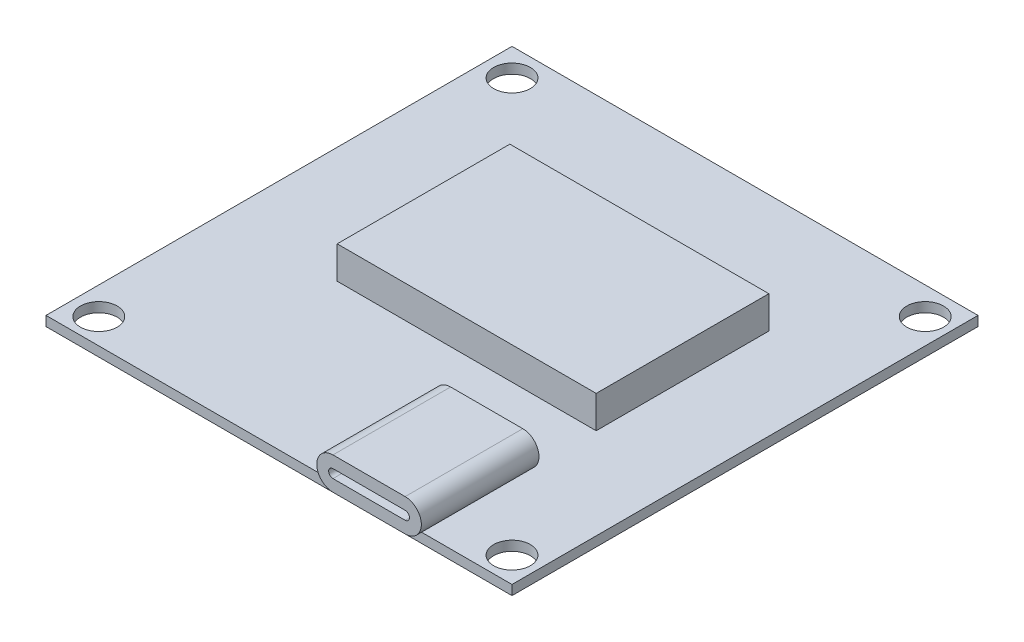
ISO-10303-21;
HEADER;
FILE_DESCRIPTION(('STEP AP214'),'2;1');
FILE_NAME('part.step','',(''),(''),'','','');
FILE_SCHEMA(('AUTOMOTIVE_DESIGN { 1 0 10303 214 1 1 1 1 }'));
ENDSEC;
DATA;
#1=APPLICATION_CONTEXT('core data for automotive mechanical design processes');
#2=APPLICATION_PROTOCOL_DEFINITION('international standard','automotive_design',2000,#1);
#3=PRODUCT_CONTEXT('',#1,'mechanical');
#4=PRODUCT('Part','Part','',(#3));
#5=PRODUCT_RELATED_PRODUCT_CATEGORY('part','',(#4));
#6=PRODUCT_DEFINITION_FORMATION('','',#4);
#7=PRODUCT_DEFINITION_CONTEXT('part definition',#1,'design');
#8=PRODUCT_DEFINITION('design','',#6,#7);
#9=PRODUCT_DEFINITION_SHAPE('','',#8);
#10=(LENGTH_UNIT() NAMED_UNIT(*) SI_UNIT(.MILLI.,.METRE.));
#11=(NAMED_UNIT(*) PLANE_ANGLE_UNIT() SI_UNIT($,.RADIAN.));
#12=(NAMED_UNIT(*) SI_UNIT($,.STERADIAN.) SOLID_ANGLE_UNIT());
#13=UNCERTAINTY_MEASURE_WITH_UNIT(LENGTH_MEASURE(1.E-05),#10,'distance_accuracy_value','');
#14=(GEOMETRIC_REPRESENTATION_CONTEXT(3) GLOBAL_UNCERTAINTY_ASSIGNED_CONTEXT((#13)) GLOBAL_UNIT_ASSIGNED_CONTEXT((#10,
#11,#12)) REPRESENTATION_CONTEXT('',''));
#15=CARTESIAN_POINT('',(0.,0.,0.));
#16=DIRECTION('',(0.,0.,1.));
#17=DIRECTION('',(1.,0.,0.));
#18=AXIS2_PLACEMENT_3D('',#15,#16,#17);
#19=CARTESIAN_POINT('',(0.,0.9,0.));
#20=DIRECTION('',(0.,-1.,0.));
#21=DIRECTION('',(0.,0.,-1.));
#22=AXIS2_PLACEMENT_3D('',#19,#20,#21);
#23=PLANE('',#22);
#24=DIRECTION('',(0.,0.,1.));
#25=VECTOR('',#24,1.);
#26=CARTESIAN_POINT('',(27.49,0.9,-10.));
#27=LINE('',#26,#25);
#28=CARTESIAN_POINT('',(27.49,0.9,-10.));
#29=VERTEX_POINT('',#28);
#30=CARTESIAN_POINT('',(27.49,0.9,0.));
#31=VERTEX_POINT('',#30);
#32=EDGE_CURVE('E244',#29,#31,#27,.T.);
#33=ORIENTED_EDGE('',*,*,#32,.F.);
#34=DIRECTION('',(1.,0.,0.));
#35=VECTOR('',#34,1.);
#36=CARTESIAN_POINT('',(27.49,0.9,-10.));
#37=LINE('',#36,#35);
#38=CARTESIAN_POINT('',(34.18,0.9,-10.));
#39=VERTEX_POINT('',#38);
#40=EDGE_CURVE('E227',#29,#39,#37,.T.);
#41=ORIENTED_EDGE('',*,*,#40,.T.);
#42=DIRECTION('',(0.,0.,1.));
#43=VECTOR('',#42,1.);
#44=CARTESIAN_POINT('',(34.18,0.9,-10.));
#45=LINE('',#44,#43);
#46=CARTESIAN_POINT('',(34.18,0.9,0.));
#47=VERTEX_POINT('',#46);
#48=EDGE_CURVE('E241',#39,#47,#45,.T.);
#49=ORIENTED_EDGE('',*,*,#48,.T.);
#50=DIRECTION('',(1.,0.,0.));
#51=VECTOR('',#50,1.);
#52=CARTESIAN_POINT('',(0.,0.9,0.));
#53=LINE('',#52,#51);
#54=CARTESIAN_POINT('',(43.18,0.9,0.));
#55=VERTEX_POINT('',#54);
#56=EDGE_CURVE('E274',#47,#55,#53,.T.);
#57=ORIENTED_EDGE('',*,*,#56,.T.);
#58=DIRECTION('',(0.,0.,-1.));
#59=VECTOR('',#58,1.);
#60=CARTESIAN_POINT('',(43.18,0.9,0.));
#61=LINE('',#60,#59);
#62=CARTESIAN_POINT('',(43.18,0.9,-43.18));
#63=VERTEX_POINT('',#62);
#64=EDGE_CURVE('E279',#55,#63,#61,.T.);
#65=ORIENTED_EDGE('',*,*,#64,.T.);
#66=DIRECTION('',(-1.,0.,0.));
#67=VECTOR('',#66,1.);
#68=CARTESIAN_POINT('',(0.,0.9,-43.18));
#69=LINE('',#68,#67);
#70=CARTESIAN_POINT('',(0.,0.9,-43.18));
#71=VERTEX_POINT('',#70);
#72=EDGE_CURVE('E282',#63,#71,#69,.T.);
#73=ORIENTED_EDGE('',*,*,#72,.T.);
#74=DIRECTION('',(0.,0.,1.));
#75=VECTOR('',#74,1.);
#76=CARTESIAN_POINT('',(0.,0.9,0.));
#77=LINE('',#76,#75);
#78=CARTESIAN_POINT('',(0.,0.9,0.));
#79=VERTEX_POINT('',#78);
#80=EDGE_CURVE('E271',#71,#79,#77,.T.);
#81=ORIENTED_EDGE('',*,*,#80,.T.);
#82=EDGE_CURVE('E276',#79,#31,#53,.T.);
#83=ORIENTED_EDGE('',*,*,#82,.T.);
#84=EDGE_LOOP('',(#33,#41,#49,#57,#65,#73,#81,#83));
#85=FACE_BOUND('',#84,.T.);
#86=CARTESIAN_POINT('',(2.54000000000008,0.9,-2.35356503375575));
#87=DIRECTION('',(0.,1.,0.));
#88=DIRECTION('',(1.,0.,0.));
#89=AXIS2_PLACEMENT_3D('',#86,#87,#88);
#90=CIRCLE('',#89,1.7);
#91=CARTESIAN_POINT('',(4.24000000000008,0.9,-2.35356503375576));
#92=VERTEX_POINT('',#91);
#93=EDGE_CURVE('E247',#92,#92,#90,.T.);
#94=ORIENTED_EDGE('',*,*,#93,.F.);
#95=EDGE_LOOP('',(#94));
#96=FACE_BOUND('',#95,.T.);
#97=CARTESIAN_POINT('',(40.8264349662442,0.9,-2.35356503375583));
#98=DIRECTION('',(0.,1.,0.));
#99=DIRECTION('',(0.,0.,-1.));
#100=AXIS2_PLACEMENT_3D('',#97,#98,#99);
#101=CIRCLE('',#100,1.7);
#102=CARTESIAN_POINT('',(40.8264349662442,0.9,-4.05356503375583));
#103=VERTEX_POINT('',#102);
#104=EDGE_CURVE('E254',#103,#103,#101,.T.);
#105=ORIENTED_EDGE('',*,*,#104,.F.);
#106=EDGE_LOOP('',(#105));
#107=FACE_BOUND('',#106,.T.);
#108=CARTESIAN_POINT('',(40.826434966244,0.9,-40.6400000000002));
#109=DIRECTION('',(0.,1.,0.));
#110=DIRECTION('',(-1.,0.,0.));
#111=AXIS2_PLACEMENT_3D('',#108,#109,#110);
#112=CIRCLE('',#111,1.7);
#113=CARTESIAN_POINT('',(39.126434966244,0.9,-40.6400000000002));
#114=VERTEX_POINT('',#113);
#115=EDGE_CURVE('E260',#114,#114,#112,.T.);
#116=ORIENTED_EDGE('',*,*,#115,.F.);
#117=EDGE_LOOP('',(#116));
#118=FACE_BOUND('',#117,.T.);
#119=CARTESIAN_POINT('',(2.54,0.9,-40.64));
#120=DIRECTION('',(0.,1.,0.));
#121=DIRECTION('',(0.,0.,1.));
#122=AXIS2_PLACEMENT_3D('',#119,#120,#121);
#123=CIRCLE('',#122,1.7);
#124=CARTESIAN_POINT('',(2.54,0.9,-38.94));
#125=VERTEX_POINT('',#124);
#126=EDGE_CURVE('E265',#125,#125,#123,.T.);
#127=ORIENTED_EDGE('',*,*,#126,.F.);
#128=EDGE_LOOP('',(#127));
#129=FACE_BOUND('',#128,.T.);
#130=DIRECTION('',(0.,0.,-1.));
#131=VECTOR('',#130,1.);
#132=CARTESIAN_POINT('',(34.7476530507671,0.9,-32.23255055401));
#133=LINE('',#132,#131);
#134=CARTESIAN_POINT('',(34.7476530507671,0.9,-16.23255055401));
#135=VERTEX_POINT('',#134);
#136=CARTESIAN_POINT('',(34.7476530507671,0.9,-32.23255055401));
#137=VERTEX_POINT('',#136);
#138=EDGE_CURVE('E174',#135,#137,#133,.T.);
#139=ORIENTED_EDGE('',*,*,#138,.F.);
#140=DIRECTION('',(1.,0.,0.));
#141=VECTOR('',#140,1.);
#142=CARTESIAN_POINT('',(34.7476530507671,0.9,-16.23255055401));
#143=LINE('',#142,#141);
#144=CARTESIAN_POINT('',(10.7476530507671,0.9,-16.23255055401));
#145=VERTEX_POINT('',#144);
#146=EDGE_CURVE('E171',#145,#135,#143,.T.);
#147=ORIENTED_EDGE('',*,*,#146,.F.);
#148=DIRECTION('',(0.,0.,1.));
#149=VECTOR('',#148,1.);
#150=CARTESIAN_POINT('',(10.7476530507671,0.9,-32.23255055401));
#151=LINE('',#150,#149);
#152=CARTESIAN_POINT('',(10.7476530507671,0.9,-32.23255055401));
#153=VERTEX_POINT('',#152);
#154=EDGE_CURVE('E55',#153,#145,#151,.T.);
#155=ORIENTED_EDGE('',*,*,#154,.F.);
#156=DIRECTION('',(-1.,0.,0.));
#157=VECTOR('',#156,1.);
#158=CARTESIAN_POINT('',(34.7476530507671,0.9,-32.23255055401));
#159=LINE('',#158,#157);
#160=EDGE_CURVE('E50',#137,#153,#159,.T.);
#161=ORIENTED_EDGE('',*,*,#160,.F.);
#162=EDGE_LOOP('',(#139,#147,#155,#161));
#163=FACE_BOUND('',#162,.T.);
#164=ADVANCED_FACE('F35',(#85,#96,#107,#118,#129,#163),#23,.F.);
#165=CARTESIAN_POINT('',(0.,0.9,0.));
#166=DIRECTION('',(1.,0.,0.));
#167=DIRECTION('',(0.,0.,-1.));
#168=AXIS2_PLACEMENT_3D('',#165,#166,#167);
#169=PLANE('',#168);
#170=DIRECTION('',(0.,0.,1.));
#171=VECTOR('',#170,1.);
#172=CARTESIAN_POINT('',(0.,0.,0.));
#173=LINE('',#172,#171);
#174=CARTESIAN_POINT('',(0.,0.,-43.18));
#175=VERTEX_POINT('',#174);
#176=CARTESIAN_POINT('',(0.,0.,0.));
#177=VERTEX_POINT('',#176);
#178=EDGE_CURVE('E268',#175,#177,#173,.T.);
#179=ORIENTED_EDGE('',*,*,#178,.T.);
#180=DIRECTION('',(0.,-1.,0.));
#181=VECTOR('',#180,1.);
#182=CARTESIAN_POINT('',(0.,0.9,0.));
#183=LINE('',#182,#181);
#184=EDGE_CURVE('E11',#79,#177,#183,.T.);
#185=ORIENTED_EDGE('',*,*,#184,.F.);
#186=ORIENTED_EDGE('',*,*,#80,.F.);
#187=DIRECTION('',(0.,-1.,0.));
#188=VECTOR('',#187,1.);
#189=CARTESIAN_POINT('',(0.,0.9,-43.18));
#190=LINE('',#189,#188);
#191=EDGE_CURVE('E284',#71,#175,#190,.T.);
#192=ORIENTED_EDGE('',*,*,#191,.T.);
#193=EDGE_LOOP('',(#179,#185,#186,#192));
#194=FACE_BOUND('',#193,.T.);
#195=ADVANCED_FACE('F37',(#194),#169,.F.);
#196=CARTESIAN_POINT('',(0.,0.9,0.));
#197=DIRECTION('',(0.,0.,-1.));
#198=DIRECTION('',(-1.,0.,0.));
#199=AXIS2_PLACEMENT_3D('',#196,#197,#198);
#200=PLANE('',#199);
#201=DIRECTION('',(1.,0.,0.));
#202=VECTOR('',#201,1.);
#203=CARTESIAN_POINT('',(0.,0.,0.));
#204=LINE('',#203,#202);
#205=CARTESIAN_POINT('',(43.18,0.,0.));
#206=VERTEX_POINT('',#205);
#207=EDGE_CURVE('E287',#177,#206,#204,.T.);
#208=ORIENTED_EDGE('',*,*,#207,.T.);
#209=DIRECTION('',(0.,-1.,0.));
#210=VECTOR('',#209,1.);
#211=CARTESIAN_POINT('',(43.18,0.9,0.));
#212=LINE('',#211,#210);
#213=EDGE_CURVE('E43',#55,#206,#212,.T.);
#214=ORIENTED_EDGE('',*,*,#213,.F.);
#215=ORIENTED_EDGE('',*,*,#56,.F.);
#216=EDGE_CURVE('E280',#31,#47,#53,.T.);
#217=ORIENTED_EDGE('',*,*,#216,.F.);
#218=ORIENTED_EDGE('',*,*,#82,.F.);
#219=ORIENTED_EDGE('',*,*,#184,.T.);
#220=EDGE_LOOP('',(#208,#214,#215,#217,#218,#219));
#221=FACE_BOUND('',#220,.T.);
#222=ADVANCED_FACE('F363',(#221),#200,.F.);
#223=CARTESIAN_POINT('',(43.18,0.9,0.));
#224=DIRECTION('',(-1.,0.,0.));
#225=DIRECTION('',(0.,0.,1.));
#226=AXIS2_PLACEMENT_3D('',#223,#224,#225);
#227=PLANE('',#226);
#228=DIRECTION('',(0.,0.,-1.));
#229=VECTOR('',#228,1.);
#230=CARTESIAN_POINT('',(43.18,0.,0.));
#231=LINE('',#230,#229);
#232=CARTESIAN_POINT('',(43.18,0.,-43.18));
#233=VERTEX_POINT('',#232);
#234=EDGE_CURVE('E289',#206,#233,#231,.T.);
#235=ORIENTED_EDGE('',*,*,#234,.T.);
#236=DIRECTION('',(0.,-1.,0.));
#237=VECTOR('',#236,1.);
#238=CARTESIAN_POINT('',(43.18,0.9,-43.18));
#239=LINE('',#238,#237);
#240=EDGE_CURVE('E294',#63,#233,#239,.T.);
#241=ORIENTED_EDGE('',*,*,#240,.F.);
#242=ORIENTED_EDGE('',*,*,#64,.F.);
#243=ORIENTED_EDGE('',*,*,#213,.T.);
#244=EDGE_LOOP('',(#235,#241,#242,#243));
#245=FACE_BOUND('',#244,.T.);
#246=ADVANCED_FACE('F301',(#245),#227,.F.);
#247=CARTESIAN_POINT('',(0.,0.9,-43.18));
#248=DIRECTION('',(0.,0.,1.));
#249=DIRECTION('',(1.,0.,0.));
#250=AXIS2_PLACEMENT_3D('',#247,#248,#249);
#251=PLANE('',#250);
#252=DIRECTION('',(-1.,0.,0.));
#253=VECTOR('',#252,1.);
#254=CARTESIAN_POINT('',(0.,0.,-43.18));
#255=LINE('',#254,#253);
#256=EDGE_CURVE('E275',#233,#175,#255,.T.);
#257=ORIENTED_EDGE('',*,*,#256,.T.);
#258=ORIENTED_EDGE('',*,*,#191,.F.);
#259=ORIENTED_EDGE('',*,*,#72,.F.);
#260=ORIENTED_EDGE('',*,*,#240,.T.);
#261=EDGE_LOOP('',(#257,#258,#259,#260));
#262=FACE_BOUND('',#261,.T.);
#263=ADVANCED_FACE('F311',(#262),#251,.F.);
#264=CARTESIAN_POINT('',(0.,0.,0.));
#265=DIRECTION('',(0.,-1.,0.));
#266=DIRECTION('',(0.,0.,-1.));
#267=AXIS2_PLACEMENT_3D('',#264,#265,#266);
#268=PLANE('',#267);
#269=CARTESIAN_POINT('',(2.54000000000008,0.,-2.35356503375575));
#270=DIRECTION('',(0.,-1.,0.));
#271=DIRECTION('',(0.,0.,-1.));
#272=AXIS2_PLACEMENT_3D('',#269,#270,#271);
#273=CIRCLE('',#272,1.7);
#274=CARTESIAN_POINT('',(2.54000000000008,0.,-4.05356503375575));
#275=VERTEX_POINT('',#274);
#276=EDGE_CURVE('E251',#275,#275,#273,.F.);
#277=ORIENTED_EDGE('',*,*,#276,.T.);
#278=EDGE_LOOP('',(#277));
#279=FACE_BOUND('',#278,.T.);
#280=CARTESIAN_POINT('',(40.8264349662442,0.,-2.35356503375583));
#281=DIRECTION('',(0.,-1.,0.));
#282=DIRECTION('',(0.,0.,-1.));
#283=AXIS2_PLACEMENT_3D('',#280,#281,#282);
#284=CIRCLE('',#283,1.7);
#285=CARTESIAN_POINT('',(40.8264349662442,0.,-4.05356503375583));
#286=VERTEX_POINT('',#285);
#287=EDGE_CURVE('E257',#286,#286,#284,.F.);
#288=ORIENTED_EDGE('',*,*,#287,.T.);
#289=EDGE_LOOP('',(#288));
#290=FACE_BOUND('',#289,.T.);
#291=CARTESIAN_POINT('',(40.826434966244,0.,-40.6400000000002));
#292=DIRECTION('',(0.,-1.,0.));
#293=DIRECTION('',(0.,0.,-1.));
#294=AXIS2_PLACEMENT_3D('',#291,#292,#293);
#295=CIRCLE('',#294,1.7);
#296=CARTESIAN_POINT('',(40.826434966244,0.,-42.3400000000002));
#297=VERTEX_POINT('',#296);
#298=EDGE_CURVE('E238',#297,#297,#295,.F.);
#299=ORIENTED_EDGE('',*,*,#298,.T.);
#300=EDGE_LOOP('',(#299));
#301=FACE_BOUND('',#300,.T.);
#302=CARTESIAN_POINT('',(2.54,0.,-40.64));
#303=DIRECTION('',(0.,-1.,0.));
#304=DIRECTION('',(0.,0.,-1.));
#305=AXIS2_PLACEMENT_3D('',#302,#303,#304);
#306=CIRCLE('',#305,1.7);
#307=CARTESIAN_POINT('',(2.54,0.,-42.34));
#308=VERTEX_POINT('',#307);
#309=EDGE_CURVE('E250',#308,#308,#306,.F.);
#310=ORIENTED_EDGE('',*,*,#309,.T.);
#311=EDGE_LOOP('',(#310));
#312=FACE_BOUND('',#311,.T.);
#313=ORIENTED_EDGE('',*,*,#178,.F.);
#314=ORIENTED_EDGE('',*,*,#256,.F.);
#315=ORIENTED_EDGE('',*,*,#234,.F.);
#316=ORIENTED_EDGE('',*,*,#207,.F.);
#317=EDGE_LOOP('',(#313,#314,#315,#316));
#318=FACE_BOUND('',#317,.T.);
#319=ADVANCED_FACE('F308',(#279,#290,#301,#312,#318),#268,.T.);
#320=CARTESIAN_POINT('',(2.54,-0.00100000000000002,-40.64));
#321=DIRECTION('',(0.,1.,0.));
#322=DIRECTION('',(0.,0.,1.));
#323=AXIS2_PLACEMENT_3D('',#320,#321,#322);
#324=CYLINDRICAL_SURFACE('',#323,1.7);
#325=ORIENTED_EDGE('',*,*,#309,.F.);
#326=EDGE_LOOP('',(#325));
#327=FACE_BOUND('',#326,.T.);
#328=ORIENTED_EDGE('',*,*,#126,.T.);
#329=EDGE_LOOP('',(#328));
#330=FACE_BOUND('',#329,.T.);
#331=ADVANCED_FACE('F366',(#327,#330),#324,.F.);
#332=CARTESIAN_POINT('',(40.826434966244,-0.00100000000000002,-40.6400000000002));
#333=DIRECTION('',(0.,1.,0.));
#334=DIRECTION('',(0.,0.,1.));
#335=AXIS2_PLACEMENT_3D('',#332,#333,#334);
#336=CYLINDRICAL_SURFACE('',#335,1.7);
#337=ORIENTED_EDGE('',*,*,#298,.F.);
#338=EDGE_LOOP('',(#337));
#339=FACE_BOUND('',#338,.T.);
#340=ORIENTED_EDGE('',*,*,#115,.T.);
#341=EDGE_LOOP('',(#340));
#342=FACE_BOUND('',#341,.T.);
#343=ADVANCED_FACE('F514',(#339,#342),#336,.F.);
#344=CARTESIAN_POINT('',(40.8264349662442,-0.00100000000000002,-2.35356503375583));
#345=DIRECTION('',(0.,1.,0.));
#346=DIRECTION('',(0.,0.,1.));
#347=AXIS2_PLACEMENT_3D('',#344,#345,#346);
#348=CYLINDRICAL_SURFACE('',#347,1.7);
#349=ORIENTED_EDGE('',*,*,#287,.F.);
#350=EDGE_LOOP('',(#349));
#351=FACE_BOUND('',#350,.T.);
#352=ORIENTED_EDGE('',*,*,#104,.T.);
#353=EDGE_LOOP('',(#352));
#354=FACE_BOUND('',#353,.T.);
#355=ADVANCED_FACE('F509',(#351,#354),#348,.F.);
#356=CARTESIAN_POINT('',(2.54000000000008,-0.00100000000000002,-2.35356503375575));
#357=DIRECTION('',(0.,1.,0.));
#358=DIRECTION('',(0.,0.,1.));
#359=AXIS2_PLACEMENT_3D('',#356,#357,#358);
#360=CYLINDRICAL_SURFACE('',#359,1.7);
#361=ORIENTED_EDGE('',*,*,#276,.F.);
#362=EDGE_LOOP('',(#361));
#363=FACE_BOUND('',#362,.T.);
#364=ORIENTED_EDGE('',*,*,#93,.T.);
#365=EDGE_LOOP('',(#364));
#366=FACE_BOUND('',#365,.T.);
#367=ADVANCED_FACE('F381',(#363,#366),#360,.F.);
#368=CARTESIAN_POINT('',(27.49,0.9,-10.));
#369=DIRECTION('',(0.,-1.,0.));
#370=DIRECTION('',(0.,0.,-1.));
#371=AXIS2_PLACEMENT_3D('',#368,#369,#370);
#372=PLANE('',#371);
#373=ORIENTED_EDGE('',*,*,#216,.T.);
#374=CARTESIAN_POINT('',(34.18,0.9,0.9));
#375=VERTEX_POINT('',#374);
#376=EDGE_CURVE('E243',#47,#375,#45,.T.);
#377=ORIENTED_EDGE('',*,*,#376,.T.);
#378=DIRECTION('',(1.,0.,0.));
#379=VECTOR('',#378,1.);
#380=CARTESIAN_POINT('',(27.49,0.9,0.9));
#381=LINE('',#380,#379);
#382=CARTESIAN_POINT('',(27.49,0.9,0.9));
#383=VERTEX_POINT('',#382);
#384=EDGE_CURVE('E195',#383,#375,#381,.T.);
#385=ORIENTED_EDGE('',*,*,#384,.F.);
#386=EDGE_CURVE('E235',#31,#383,#27,.T.);
#387=ORIENTED_EDGE('',*,*,#386,.F.);
#388=EDGE_LOOP('',(#373,#377,#385,#387));
#389=FACE_BOUND('',#388,.T.);
#390=ADVANCED_FACE('F323',(#389),#372,.T.);
#391=CARTESIAN_POINT('',(27.49,2.4,-10.));
#392=DIRECTION('',(0.,0.,1.));
#393=DIRECTION('',(1.,0.,0.));
#394=AXIS2_PLACEMENT_3D('',#391,#392,#393);
#395=CYLINDRICAL_SURFACE('',#394,1.5);
#396=ORIENTED_EDGE('',*,*,#32,.T.);
#397=ORIENTED_EDGE('',*,*,#386,.T.);
#398=CARTESIAN_POINT('',(27.49,2.4,0.9));
#399=DIRECTION('',(0.,0.,1.));
#400=DIRECTION('',(1.,0.,0.));
#401=AXIS2_PLACEMENT_3D('',#398,#399,#400);
#402=CIRCLE('',#401,1.5);
#403=CARTESIAN_POINT('',(27.49,3.9,0.9));
#404=VERTEX_POINT('',#403);
#405=EDGE_CURVE('E192',#404,#383,#402,.T.);
#406=ORIENTED_EDGE('',*,*,#405,.F.);
#407=DIRECTION('',(0.,0.,1.));
#408=VECTOR('',#407,1.);
#409=CARTESIAN_POINT('',(27.49,3.9,-10.));
#410=LINE('',#409,#408);
#411=CARTESIAN_POINT('',(27.49,3.9,-10.));
#412=VERTEX_POINT('',#411);
#413=EDGE_CURVE('E236',#412,#404,#410,.T.);
#414=ORIENTED_EDGE('',*,*,#413,.F.);
#415=CARTESIAN_POINT('',(27.49,2.4,-10.));
#416=DIRECTION('',(0.,0.,1.));
#417=DIRECTION('',(1.,0.,0.));
#418=AXIS2_PLACEMENT_3D('',#415,#416,#417);
#419=CIRCLE('',#418,1.5);
#420=EDGE_CURVE('E219',#412,#29,#419,.T.);
#421=ORIENTED_EDGE('',*,*,#420,.T.);
#422=EDGE_LOOP('',(#396,#397,#406,#414,#421));
#423=FACE_BOUND('',#422,.T.);
#424=ADVANCED_FACE('F339',(#423),#395,.T.);
#425=CARTESIAN_POINT('',(27.49,3.9,-10.));
#426=DIRECTION('',(0.,1.,0.));
#427=DIRECTION('',(0.,0.,1.));
#428=AXIS2_PLACEMENT_3D('',#425,#426,#427);
#429=PLANE('',#428);
#430=ORIENTED_EDGE('',*,*,#413,.T.);
#431=DIRECTION('',(-1.,0.,0.));
#432=VECTOR('',#431,1.);
#433=CARTESIAN_POINT('',(27.49,3.9,0.9));
#434=LINE('',#433,#432);
#435=CARTESIAN_POINT('',(34.18,3.9,0.9));
#436=VERTEX_POINT('',#435);
#437=EDGE_CURVE('E201',#436,#404,#434,.T.);
#438=ORIENTED_EDGE('',*,*,#437,.F.);
#439=DIRECTION('',(0.,0.,1.));
#440=VECTOR('',#439,1.);
#441=CARTESIAN_POINT('',(34.18,3.9,-10.));
#442=LINE('',#441,#440);
#443=CARTESIAN_POINT('',(34.18,3.9,-10.));
#444=VERTEX_POINT('',#443);
#445=EDGE_CURVE('E239',#444,#436,#442,.T.);
#446=ORIENTED_EDGE('',*,*,#445,.F.);
#447=DIRECTION('',(-1.,0.,0.));
#448=VECTOR('',#447,1.);
#449=CARTESIAN_POINT('',(27.49,3.9,-10.));
#450=LINE('',#449,#448);
#451=EDGE_CURVE('E232',#444,#412,#450,.T.);
#452=ORIENTED_EDGE('',*,*,#451,.T.);
#453=EDGE_LOOP('',(#430,#438,#446,#452));
#454=FACE_BOUND('',#453,.T.);
#455=ADVANCED_FACE('F335',(#454),#429,.T.);
#456=CARTESIAN_POINT('',(34.18,2.4,-10.));
#457=DIRECTION('',(0.,0.,1.));
#458=DIRECTION('',(1.,0.,0.));
#459=AXIS2_PLACEMENT_3D('',#456,#457,#458);
#460=CYLINDRICAL_SURFACE('',#459,1.5);
#461=ORIENTED_EDGE('',*,*,#445,.T.);
#462=CARTESIAN_POINT('',(34.18,2.4,0.9));
#463=DIRECTION('',(0.,0.,1.));
#464=DIRECTION('',(1.,0.,0.));
#465=AXIS2_PLACEMENT_3D('',#462,#463,#464);
#466=CIRCLE('',#465,1.5);
#467=EDGE_CURVE('E198',#375,#436,#466,.T.);
#468=ORIENTED_EDGE('',*,*,#467,.F.);
#469=ORIENTED_EDGE('',*,*,#376,.F.);
#470=ORIENTED_EDGE('',*,*,#48,.F.);
#471=CARTESIAN_POINT('',(34.18,2.4,-10.));
#472=DIRECTION('',(0.,0.,1.));
#473=DIRECTION('',(1.,0.,0.));
#474=AXIS2_PLACEMENT_3D('',#471,#472,#473);
#475=CIRCLE('',#474,1.5);
#476=EDGE_CURVE('E229',#39,#444,#475,.T.);
#477=ORIENTED_EDGE('',*,*,#476,.T.);
#478=EDGE_LOOP('',(#461,#468,#469,#470,#477));
#479=FACE_BOUND('',#478,.T.);
#480=ADVANCED_FACE('F327',(#479),#460,.T.);
#481=CARTESIAN_POINT('',(27.49,2.4,-10.));
#482=DIRECTION('',(0.,0.,1.));
#483=DIRECTION('',(1.,0.,0.));
#484=AXIS2_PLACEMENT_3D('',#481,#482,#483);
#485=PLANE('',#484);
#486=DIRECTION('',(-1.,0.,0.));
#487=VECTOR('',#486,1.);
#488=CARTESIAN_POINT('',(27.49,2.8,-10.));
#489=LINE('',#488,#487);
#490=CARTESIAN_POINT('',(34.18,2.8,-10.));
#491=VERTEX_POINT('',#490);
#492=CARTESIAN_POINT('',(27.49,2.8,-10.));
#493=VERTEX_POINT('',#492);
#494=EDGE_CURVE('E213',#491,#493,#489,.T.);
#495=ORIENTED_EDGE('',*,*,#494,.T.);
#496=CARTESIAN_POINT('',(27.49,2.4,-10.));
#497=DIRECTION('',(0.,0.,1.));
#498=DIRECTION('',(1.,0.,0.));
#499=AXIS2_PLACEMENT_3D('',#496,#497,#498);
#500=CIRCLE('',#499,0.4);
#501=CARTESIAN_POINT('',(27.49,2.,-10.));
#502=VERTEX_POINT('',#501);
#503=EDGE_CURVE('E204',#493,#502,#500,.T.);
#504=ORIENTED_EDGE('',*,*,#503,.T.);
#505=DIRECTION('',(1.,0.,0.));
#506=VECTOR('',#505,1.);
#507=CARTESIAN_POINT('',(27.49,2.,-10.));
#508=LINE('',#507,#506);
#509=CARTESIAN_POINT('',(34.18,2.,-10.));
#510=VERTEX_POINT('',#509);
#511=EDGE_CURVE('E207',#502,#510,#508,.T.);
#512=ORIENTED_EDGE('',*,*,#511,.T.);
#513=CARTESIAN_POINT('',(34.18,2.4,-10.));
#514=DIRECTION('',(0.,0.,1.));
#515=DIRECTION('',(1.,0.,0.));
#516=AXIS2_PLACEMENT_3D('',#513,#514,#515);
#517=CIRCLE('',#516,0.4);
#518=EDGE_CURVE('E210',#510,#491,#517,.T.);
#519=ORIENTED_EDGE('',*,*,#518,.T.);
#520=EDGE_LOOP('',(#495,#504,#512,#519));
#521=FACE_BOUND('',#520,.T.);
#522=ORIENTED_EDGE('',*,*,#420,.F.);
#523=ORIENTED_EDGE('',*,*,#451,.F.);
#524=ORIENTED_EDGE('',*,*,#476,.F.);
#525=ORIENTED_EDGE('',*,*,#40,.F.);
#526=EDGE_LOOP('',(#522,#523,#524,#525));
#527=FACE_BOUND('',#526,.T.);
#528=ADVANCED_FACE('F342',(#521,#527),#485,.F.);
#529=CARTESIAN_POINT('',(27.49,2.4,-10.));
#530=DIRECTION('',(0.,0.,1.));
#531=DIRECTION('',(1.,0.,0.));
#532=AXIS2_PLACEMENT_3D('',#529,#530,#531);
#533=CYLINDRICAL_SURFACE('',#532,0.4);
#534=DIRECTION('',(0.,0.,1.));
#535=VECTOR('',#534,1.);
#536=CARTESIAN_POINT('',(27.49,2.8,-10.));
#537=LINE('',#536,#535);
#538=CARTESIAN_POINT('',(27.49,2.8,0.9));
#539=VERTEX_POINT('',#538);
#540=EDGE_CURVE('E217',#493,#539,#537,.T.);
#541=ORIENTED_EDGE('',*,*,#540,.T.);
#542=CARTESIAN_POINT('',(27.49,2.4,0.9));
#543=DIRECTION('',(0.,0.,1.));
#544=DIRECTION('',(1.,0.,0.));
#545=AXIS2_PLACEMENT_3D('',#542,#543,#544);
#546=CIRCLE('',#545,0.4);
#547=CARTESIAN_POINT('',(27.49,2.,0.9));
#548=VERTEX_POINT('',#547);
#549=EDGE_CURVE('E175',#539,#548,#546,.T.);
#550=ORIENTED_EDGE('',*,*,#549,.T.);
#551=DIRECTION('',(0.,0.,1.));
#552=VECTOR('',#551,1.);
#553=CARTESIAN_POINT('',(27.49,2.,-10.));
#554=LINE('',#553,#552);
#555=EDGE_CURVE('E216',#502,#548,#554,.T.);
#556=ORIENTED_EDGE('',*,*,#555,.F.);
#557=ORIENTED_EDGE('',*,*,#503,.F.);
#558=EDGE_LOOP('',(#541,#550,#556,#557));
#559=FACE_BOUND('',#558,.T.);
#560=ADVANCED_FACE('F344',(#559),#533,.F.);
#561=CARTESIAN_POINT('',(27.49,2.8,-10.));
#562=DIRECTION('',(0.,1.,0.));
#563=DIRECTION('',(0.,0.,1.));
#564=AXIS2_PLACEMENT_3D('',#561,#562,#563);
#565=PLANE('',#564);
#566=DIRECTION('',(0.,0.,1.));
#567=VECTOR('',#566,1.);
#568=CARTESIAN_POINT('',(34.18,2.8,-10.));
#569=LINE('',#568,#567);
#570=CARTESIAN_POINT('',(34.18,2.8,0.9));
#571=VERTEX_POINT('',#570);
#572=EDGE_CURVE('E220',#491,#571,#569,.T.);
#573=ORIENTED_EDGE('',*,*,#572,.T.);
#574=DIRECTION('',(-1.,0.,0.));
#575=VECTOR('',#574,1.);
#576=CARTESIAN_POINT('',(27.49,2.8,0.9));
#577=LINE('',#576,#575);
#578=EDGE_CURVE('E189',#571,#539,#577,.T.);
#579=ORIENTED_EDGE('',*,*,#578,.T.);
#580=ORIENTED_EDGE('',*,*,#540,.F.);
#581=ORIENTED_EDGE('',*,*,#494,.F.);
#582=EDGE_LOOP('',(#573,#579,#580,#581));
#583=FACE_BOUND('',#582,.T.);
#584=ADVANCED_FACE('F351',(#583),#565,.F.);
#585=CARTESIAN_POINT('',(34.18,2.4,-10.));
#586=DIRECTION('',(0.,0.,1.));
#587=DIRECTION('',(1.,0.,0.));
#588=AXIS2_PLACEMENT_3D('',#585,#586,#587);
#589=CYLINDRICAL_SURFACE('',#588,0.4);
#590=DIRECTION('',(0.,0.,1.));
#591=VECTOR('',#590,1.);
#592=CARTESIAN_POINT('',(34.18,2.,-10.));
#593=LINE('',#592,#591);
#594=CARTESIAN_POINT('',(34.18,2.,0.9));
#595=VERTEX_POINT('',#594);
#596=EDGE_CURVE('E222',#510,#595,#593,.T.);
#597=ORIENTED_EDGE('',*,*,#596,.T.);
#598=CARTESIAN_POINT('',(34.18,2.4,0.9));
#599=DIRECTION('',(0.,0.,1.));
#600=DIRECTION('',(1.,0.,0.));
#601=AXIS2_PLACEMENT_3D('',#598,#599,#600);
#602=CIRCLE('',#601,0.4);
#603=EDGE_CURVE('E186',#595,#571,#602,.T.);
#604=ORIENTED_EDGE('',*,*,#603,.T.);
#605=ORIENTED_EDGE('',*,*,#572,.F.);
#606=ORIENTED_EDGE('',*,*,#518,.F.);
#607=EDGE_LOOP('',(#597,#604,#605,#606));
#608=FACE_BOUND('',#607,.T.);
#609=ADVANCED_FACE('F429',(#608),#589,.F.);
#610=CARTESIAN_POINT('',(27.49,2.,-10.));
#611=DIRECTION('',(0.,-1.,0.));
#612=DIRECTION('',(0.,0.,-1.));
#613=AXIS2_PLACEMENT_3D('',#610,#611,#612);
#614=PLANE('',#613);
#615=ORIENTED_EDGE('',*,*,#555,.T.);
#616=DIRECTION('',(1.,0.,0.));
#617=VECTOR('',#616,1.);
#618=CARTESIAN_POINT('',(27.49,2.,0.9));
#619=LINE('',#618,#617);
#620=EDGE_CURVE('E178',#548,#595,#619,.T.);
#621=ORIENTED_EDGE('',*,*,#620,.T.);
#622=ORIENTED_EDGE('',*,*,#596,.F.);
#623=ORIENTED_EDGE('',*,*,#511,.F.);
#624=EDGE_LOOP('',(#615,#621,#622,#623));
#625=FACE_BOUND('',#624,.T.);
#626=ADVANCED_FACE('F439',(#625),#614,.F.);
#627=CARTESIAN_POINT('',(27.49,2.4,0.9));
#628=DIRECTION('',(0.,0.,1.));
#629=DIRECTION('',(1.,0.,0.));
#630=AXIS2_PLACEMENT_3D('',#627,#628,#629);
#631=PLANE('',#630);
#632=ORIENTED_EDGE('',*,*,#405,.T.);
#633=ORIENTED_EDGE('',*,*,#384,.T.);
#634=ORIENTED_EDGE('',*,*,#467,.T.);
#635=ORIENTED_EDGE('',*,*,#437,.T.);
#636=EDGE_LOOP('',(#632,#633,#634,#635));
#637=FACE_BOUND('',#636,.T.);
#638=ORIENTED_EDGE('',*,*,#620,.F.);
#639=ORIENTED_EDGE('',*,*,#549,.F.);
#640=ORIENTED_EDGE('',*,*,#578,.F.);
#641=ORIENTED_EDGE('',*,*,#603,.F.);
#642=EDGE_LOOP('',(#638,#639,#640,#641));
#643=FACE_BOUND('',#642,.T.);
#644=ADVANCED_FACE('F331',(#637,#643),#631,.T.);
#645=CARTESIAN_POINT('',(34.7476530507671,3.9,-32.23255055401));
#646=DIRECTION('',(-1.,0.,0.));
#647=DIRECTION('',(0.,0.,1.));
#648=AXIS2_PLACEMENT_3D('',#645,#646,#647);
#649=PLANE('',#648);
#650=ORIENTED_EDGE('',*,*,#138,.T.);
#651=DIRECTION('',(0.,-1.,0.));
#652=VECTOR('',#651,1.);
#653=CARTESIAN_POINT('',(34.7476530507671,3.9,-32.23255055401));
#654=LINE('',#653,#652);
#655=CARTESIAN_POINT('',(34.7476530507671,3.9,-32.23255055401));
#656=VERTEX_POINT('',#655);
#657=EDGE_CURVE('E155',#656,#137,#654,.T.);
#658=ORIENTED_EDGE('',*,*,#657,.F.);
#659=DIRECTION('',(0.,0.,-1.));
#660=VECTOR('',#659,1.);
#661=CARTESIAN_POINT('',(34.7476530507671,3.9,-32.23255055401));
#662=LINE('',#661,#660);
#663=CARTESIAN_POINT('',(34.7476530507671,3.9,-16.23255055401));
#664=VERTEX_POINT('',#663);
#665=EDGE_CURVE('E162',#664,#656,#662,.T.);
#666=ORIENTED_EDGE('',*,*,#665,.F.);
#667=DIRECTION('',(0.,-1.,0.));
#668=VECTOR('',#667,1.);
#669=CARTESIAN_POINT('',(34.7476530507671,3.9,-16.23255055401));
#670=LINE('',#669,#668);
#671=EDGE_CURVE('E571',#664,#135,#670,.T.);
#672=ORIENTED_EDGE('',*,*,#671,.T.);
#673=EDGE_LOOP('',(#650,#658,#666,#672));
#674=FACE_BOUND('',#673,.T.);
#675=ADVANCED_FACE('F173',(#674),#649,.F.);
#676=CARTESIAN_POINT('',(34.7476530507671,3.9,-32.23255055401));
#677=DIRECTION('',(0.,0.,1.));
#678=DIRECTION('',(1.,0.,0.));
#679=AXIS2_PLACEMENT_3D('',#676,#677,#678);
#680=PLANE('',#679);
#681=ORIENTED_EDGE('',*,*,#160,.T.);
#682=DIRECTION('',(0.,-1.,0.));
#683=VECTOR('',#682,1.);
#684=CARTESIAN_POINT('',(10.7476530507671,3.9,-32.23255055401));
#685=LINE('',#684,#683);
#686=CARTESIAN_POINT('',(10.7476530507671,3.9,-32.23255055401));
#687=VERTEX_POINT('',#686);
#688=EDGE_CURVE('E158',#687,#153,#685,.T.);
#689=ORIENTED_EDGE('',*,*,#688,.F.);
#690=DIRECTION('',(-1.,0.,0.));
#691=VECTOR('',#690,1.);
#692=CARTESIAN_POINT('',(34.7476530507671,3.9,-32.23255055401));
#693=LINE('',#692,#691);
#694=EDGE_CURVE('E151',#656,#687,#693,.T.);
#695=ORIENTED_EDGE('',*,*,#694,.F.);
#696=ORIENTED_EDGE('',*,*,#657,.T.);
#697=EDGE_LOOP('',(#681,#689,#695,#696));
#698=FACE_BOUND('',#697,.T.);
#699=ADVANCED_FACE('F153',(#698),#680,.F.);
#700=CARTESIAN_POINT('',(10.7476530507671,3.9,-32.23255055401));
#701=DIRECTION('',(1.,0.,0.));
#702=DIRECTION('',(0.,0.,-1.));
#703=AXIS2_PLACEMENT_3D('',#700,#701,#702);
#704=PLANE('',#703);
#705=ORIENTED_EDGE('',*,*,#154,.T.);
#706=DIRECTION('',(0.,-1.,0.));
#707=VECTOR('',#706,1.);
#708=CARTESIAN_POINT('',(10.7476530507671,3.9,-16.23255055401));
#709=LINE('',#708,#707);
#710=CARTESIAN_POINT('',(10.7476530507671,3.9,-16.23255055401));
#711=VERTEX_POINT('',#710);
#712=EDGE_CURVE('E180',#711,#145,#709,.T.);
#713=ORIENTED_EDGE('',*,*,#712,.F.);
#714=DIRECTION('',(0.,0.,1.));
#715=VECTOR('',#714,1.);
#716=CARTESIAN_POINT('',(10.7476530507671,3.9,-32.23255055401));
#717=LINE('',#716,#715);
#718=EDGE_CURVE('E161',#687,#711,#717,.T.);
#719=ORIENTED_EDGE('',*,*,#718,.F.);
#720=ORIENTED_EDGE('',*,*,#688,.T.);
#721=EDGE_LOOP('',(#705,#713,#719,#720));
#722=FACE_BOUND('',#721,.T.);
#723=ADVANCED_FACE('F470',(#722),#704,.F.);
#724=CARTESIAN_POINT('',(34.7476530507671,3.9,-16.23255055401));
#725=DIRECTION('',(0.,0.,-1.));
#726=DIRECTION('',(-1.,0.,0.));
#727=AXIS2_PLACEMENT_3D('',#724,#725,#726);
#728=PLANE('',#727);
#729=ORIENTED_EDGE('',*,*,#146,.T.);
#730=ORIENTED_EDGE('',*,*,#671,.F.);
#731=DIRECTION('',(1.,0.,0.));
#732=VECTOR('',#731,1.);
#733=CARTESIAN_POINT('',(34.7476530507671,3.9,-16.23255055401));
#734=LINE('',#733,#732);
#735=EDGE_CURVE('E167',#711,#664,#734,.T.);
#736=ORIENTED_EDGE('',*,*,#735,.F.);
#737=ORIENTED_EDGE('',*,*,#712,.T.);
#738=EDGE_LOOP('',(#729,#730,#736,#737));
#739=FACE_BOUND('',#738,.T.);
#740=ADVANCED_FACE('F477',(#739),#728,.F.);
#741=CARTESIAN_POINT('',(0.,3.9,0.));
#742=DIRECTION('',(0.,-1.,0.));
#743=DIRECTION('',(0.,0.,-1.));
#744=AXIS2_PLACEMENT_3D('',#741,#742,#743);
#745=PLANE('',#744);
#746=ORIENTED_EDGE('',*,*,#665,.T.);
#747=ORIENTED_EDGE('',*,*,#694,.T.);
#748=ORIENTED_EDGE('',*,*,#718,.T.);
#749=ORIENTED_EDGE('',*,*,#735,.T.);
#750=EDGE_LOOP('',(#746,#747,#748,#749));
#751=FACE_BOUND('',#750,.T.);
#752=ADVANCED_FACE('F165',(#751),#745,.F.);
#753=CLOSED_SHELL('',(#164,#195,#222,#246,#263,#319,#331,#343,#355,#367,#390,#424,#455,#480,
#528,#560,#584,#609,#626,#644,#675,#699,#723,#740,#752));
#754=MANIFOLD_SOLID_BREP('B2',#753);
#755=ADVANCED_BREP_SHAPE_REPRESENTATION('',(#18,#754),#14);
#756=SHAPE_DEFINITION_REPRESENTATION(#9,#755);
ENDSEC;
END-ISO-10303-21;
